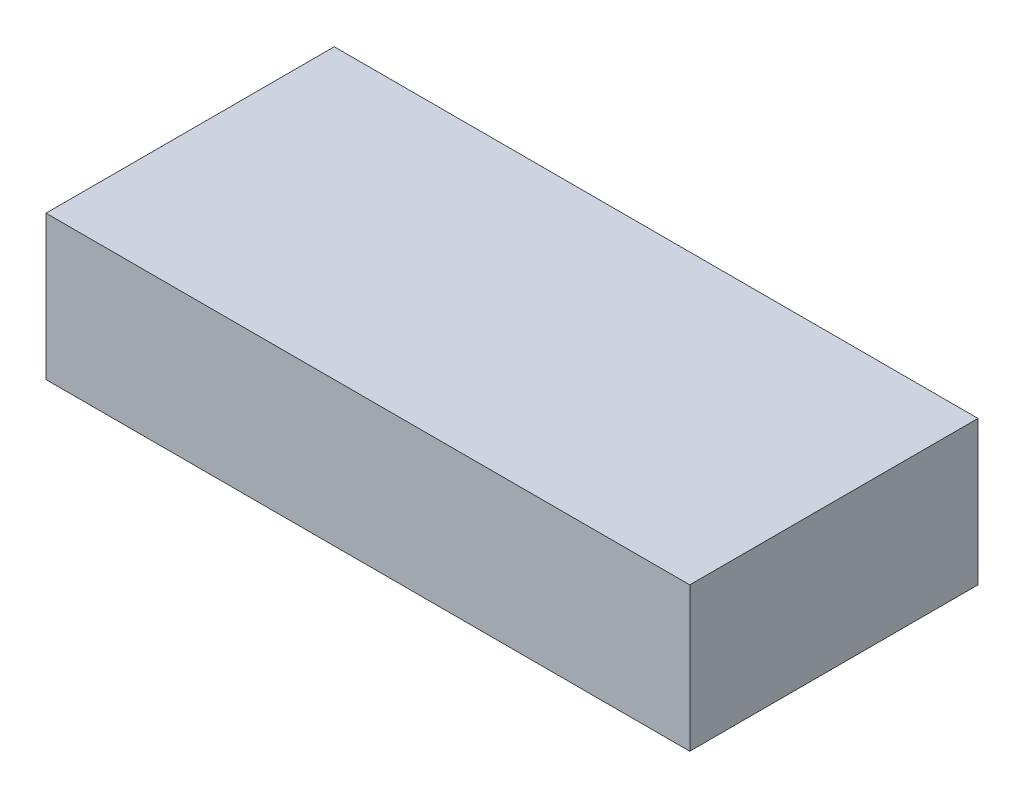
ISO-10303-21;
HEADER;
FILE_DESCRIPTION(('STEP AP214'),'2;1');
FILE_NAME('part.step','',(''),(''),'','','');
FILE_SCHEMA(('AUTOMOTIVE_DESIGN { 1 0 10303 214 1 1 1 1 }'));
ENDSEC;
DATA;
#1=APPLICATION_CONTEXT('core data for automotive mechanical design processes');
#2=APPLICATION_PROTOCOL_DEFINITION('international standard','automotive_design',2000,#1);
#3=PRODUCT_CONTEXT('',#1,'mechanical');
#4=PRODUCT('Part','Part','',(#3));
#5=PRODUCT_RELATED_PRODUCT_CATEGORY('part','',(#4));
#6=PRODUCT_DEFINITION_FORMATION('','',#4);
#7=PRODUCT_DEFINITION_CONTEXT('part definition',#1,'design');
#8=PRODUCT_DEFINITION('design','',#6,#7);
#9=PRODUCT_DEFINITION_SHAPE('','',#8);
#10=(LENGTH_UNIT() NAMED_UNIT(*) SI_UNIT(.MILLI.,.METRE.));
#11=(NAMED_UNIT(*) PLANE_ANGLE_UNIT() SI_UNIT($,.RADIAN.));
#12=(NAMED_UNIT(*) SI_UNIT($,.STERADIAN.) SOLID_ANGLE_UNIT());
#13=UNCERTAINTY_MEASURE_WITH_UNIT(LENGTH_MEASURE(1.E-05),#10,'distance_accuracy_value','');
#14=(GEOMETRIC_REPRESENTATION_CONTEXT(3) GLOBAL_UNCERTAINTY_ASSIGNED_CONTEXT((#13)) GLOBAL_UNIT_ASSIGNED_CONTEXT((#10,
#11,#12)) REPRESENTATION_CONTEXT('',''));
#15=CARTESIAN_POINT('',(0.,0.,0.));
#16=DIRECTION('',(0.,0.,1.));
#17=DIRECTION('',(1.,0.,0.));
#18=AXIS2_PLACEMENT_3D('',#15,#16,#17);
#19=CARTESIAN_POINT('',(0.,15.,0.));
#20=DIRECTION('',(1.,0.,0.));
#21=DIRECTION('',(0.,0.,1.));
#22=AXIS2_PLACEMENT_3D('',#19,#20,#21);
#23=PLANE('',#22);
#24=DIRECTION('',(0.,0.,-1.));
#25=VECTOR('',#24,1.);
#26=CARTESIAN_POINT('',(0.,0.,0.));
#27=LINE('',#26,#25);
#28=CARTESIAN_POINT('',(0.,0.,30.));
#29=VERTEX_POINT('',#28);
#30=CARTESIAN_POINT('',(0.,0.,0.));
#31=VERTEX_POINT('',#30);
#32=EDGE_CURVE('E100',#29,#31,#27,.T.);
#33=ORIENTED_EDGE('',*,*,#32,.F.);
#34=DIRECTION('',(0.,-1.,0.));
#35=VECTOR('',#34,1.);
#36=CARTESIAN_POINT('',(0.,15.,30.));
#37=LINE('',#36,#35);
#38=CARTESIAN_POINT('',(0.,15.,30.));
#39=VERTEX_POINT('',#38);
#40=EDGE_CURVE('E99',#39,#29,#37,.T.);
#41=ORIENTED_EDGE('',*,*,#40,.F.);
#42=DIRECTION('',(0.,0.,-1.));
#43=VECTOR('',#42,1.);
#44=CARTESIAN_POINT('',(0.,15.,0.));
#45=LINE('',#44,#43);
#46=CARTESIAN_POINT('',(0.,15.,0.));
#47=VERTEX_POINT('',#46);
#48=EDGE_CURVE('E94',#39,#47,#45,.T.);
#49=ORIENTED_EDGE('',*,*,#48,.T.);
#50=DIRECTION('',(0.,-1.,0.));
#51=VECTOR('',#50,1.);
#52=CARTESIAN_POINT('',(0.,15.,0.));
#53=LINE('',#52,#51);
#54=EDGE_CURVE('E11',#47,#31,#53,.T.);
#55=ORIENTED_EDGE('',*,*,#54,.T.);
#56=EDGE_LOOP('',(#33,#41,#49,#55));
#57=FACE_BOUND('',#56,.T.);
#58=ADVANCED_FACE('F37',(#57),#23,.F.);
#59=CARTESIAN_POINT('',(0.,15.,0.));
#60=DIRECTION('',(0.,0.,1.));
#61=DIRECTION('',(-1.,0.,0.));
#62=AXIS2_PLACEMENT_3D('',#59,#60,#61);
#63=PLANE('',#62);
#64=DIRECTION('',(1.,0.,0.));
#65=VECTOR('',#64,1.);
#66=CARTESIAN_POINT('',(0.,0.,0.));
#67=LINE('',#66,#65);
#68=CARTESIAN_POINT('',(67.,0.,0.));
#69=VERTEX_POINT('',#68);
#70=EDGE_CURVE('E102',#31,#69,#67,.T.);
#71=ORIENTED_EDGE('',*,*,#70,.F.);
#72=ORIENTED_EDGE('',*,*,#54,.F.);
#73=DIRECTION('',(1.,0.,0.));
#74=VECTOR('',#73,1.);
#75=CARTESIAN_POINT('',(0.,15.,0.));
#76=LINE('',#75,#74);
#77=CARTESIAN_POINT('',(67.,15.,0.));
#78=VERTEX_POINT('',#77);
#79=EDGE_CURVE('E78',#47,#78,#76,.T.);
#80=ORIENTED_EDGE('',*,*,#79,.T.);
#81=DIRECTION('',(0.,-1.,0.));
#82=VECTOR('',#81,1.);
#83=CARTESIAN_POINT('',(67.,15.,0.));
#84=LINE('',#83,#82);
#85=EDGE_CURVE('E45',#78,#69,#84,.T.);
#86=ORIENTED_EDGE('',*,*,#85,.T.);
#87=EDGE_LOOP('',(#71,#72,#80,#86));
#88=FACE_BOUND('',#87,.T.);
#89=ADVANCED_FACE('F92',(#88),#63,.F.);
#90=CARTESIAN_POINT('',(67.,15.,0.));
#91=DIRECTION('',(-1.,0.,0.));
#92=DIRECTION('',(0.,0.,-1.));
#93=AXIS2_PLACEMENT_3D('',#90,#91,#92);
#94=PLANE('',#93);
#95=DIRECTION('',(0.,0.,1.));
#96=VECTOR('',#95,1.);
#97=CARTESIAN_POINT('',(67.,0.,0.));
#98=LINE('',#97,#96);
#99=CARTESIAN_POINT('',(67.,0.,30.));
#100=VERTEX_POINT('',#99);
#101=EDGE_CURVE('E88',#69,#100,#98,.T.);
#102=ORIENTED_EDGE('',*,*,#101,.F.);
#103=ORIENTED_EDGE('',*,*,#85,.F.);
#104=DIRECTION('',(0.,0.,1.));
#105=VECTOR('',#104,1.);
#106=CARTESIAN_POINT('',(67.,15.,0.));
#107=LINE('',#106,#105);
#108=CARTESIAN_POINT('',(67.,15.,30.));
#109=VERTEX_POINT('',#108);
#110=EDGE_CURVE('E81',#78,#109,#107,.T.);
#111=ORIENTED_EDGE('',*,*,#110,.T.);
#112=DIRECTION('',(0.,-1.,0.));
#113=VECTOR('',#112,1.);
#114=CARTESIAN_POINT('',(67.,15.,30.));
#115=LINE('',#114,#113);
#116=EDGE_CURVE('E91',#109,#100,#115,.T.);
#117=ORIENTED_EDGE('',*,*,#116,.T.);
#118=EDGE_LOOP('',(#102,#103,#111,#117));
#119=FACE_BOUND('',#118,.T.);
#120=ADVANCED_FACE('F87',(#119),#94,.F.);
#121=CARTESIAN_POINT('',(0.,15.,30.));
#122=DIRECTION('',(0.,0.,-1.));
#123=DIRECTION('',(1.,0.,0.));
#124=AXIS2_PLACEMENT_3D('',#121,#122,#123);
#125=PLANE('',#124);
#126=DIRECTION('',(-1.,0.,0.));
#127=VECTOR('',#126,1.);
#128=CARTESIAN_POINT('',(0.,0.,30.));
#129=LINE('',#128,#127);
#130=EDGE_CURVE('E67',#100,#29,#129,.T.);
#131=ORIENTED_EDGE('',*,*,#130,.F.);
#132=ORIENTED_EDGE('',*,*,#116,.F.);
#133=DIRECTION('',(-1.,0.,0.));
#134=VECTOR('',#133,1.);
#135=CARTESIAN_POINT('',(0.,15.,30.));
#136=LINE('',#135,#134);
#137=EDGE_CURVE('E53',#109,#39,#136,.T.);
#138=ORIENTED_EDGE('',*,*,#137,.T.);
#139=ORIENTED_EDGE('',*,*,#40,.T.);
#140=EDGE_LOOP('',(#131,#132,#138,#139));
#141=FACE_BOUND('',#140,.T.);
#142=ADVANCED_FACE('F111',(#141),#125,.F.);
#143=CARTESIAN_POINT('',(0.,15.,0.));
#144=DIRECTION('',(0.,-1.,0.));
#145=DIRECTION('',(0.,0.,1.));
#146=AXIS2_PLACEMENT_3D('',#143,#144,#145);
#147=PLANE('',#146);
#148=ORIENTED_EDGE('',*,*,#48,.F.);
#149=ORIENTED_EDGE('',*,*,#137,.F.);
#150=ORIENTED_EDGE('',*,*,#110,.F.);
#151=ORIENTED_EDGE('',*,*,#79,.F.);
#152=EDGE_LOOP('',(#148,#149,#150,#151));
#153=FACE_BOUND('',#152,.T.);
#154=ADVANCED_FACE('F83',(#153),#147,.F.);
#155=CARTESIAN_POINT('',(0.,0.,0.));
#156=DIRECTION('',(0.,-1.,0.));
#157=DIRECTION('',(0.,0.,1.));
#158=AXIS2_PLACEMENT_3D('',#155,#156,#157);
#159=PLANE('',#158);
#160=ORIENTED_EDGE('',*,*,#32,.T.);
#161=ORIENTED_EDGE('',*,*,#70,.T.);
#162=ORIENTED_EDGE('',*,*,#101,.T.);
#163=ORIENTED_EDGE('',*,*,#130,.T.);
#164=EDGE_LOOP('',(#160,#161,#162,#163));
#165=FACE_BOUND('',#164,.T.);
#166=ADVANCED_FACE('F107',(#165),#159,.T.);
#167=CLOSED_SHELL('',(#58,#89,#120,#142,#154,#166));
#168=MANIFOLD_SOLID_BREP('B2',#167);
#169=ADVANCED_BREP_SHAPE_REPRESENTATION('',(#18,#168),#14);
#170=SHAPE_DEFINITION_REPRESENTATION(#9,#169);
ENDSEC;
END-ISO-10303-21;
